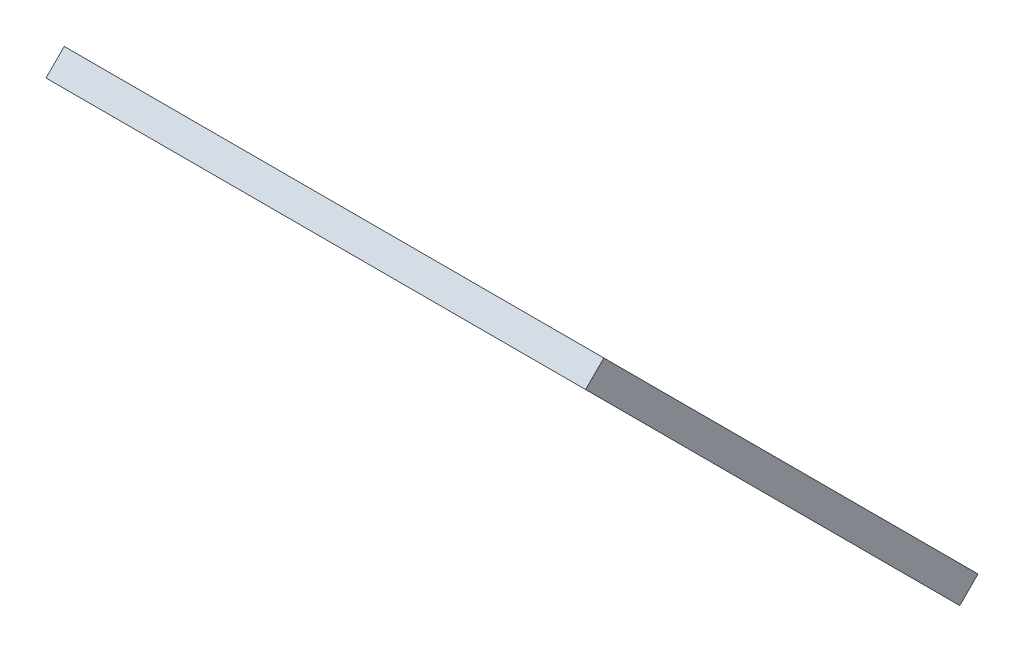
ISO-10303-21;
HEADER;
FILE_DESCRIPTION(('STEP AP214'),'2;1');
FILE_NAME('part.step','',(''),(''),'','','');
FILE_SCHEMA(('AUTOMOTIVE_DESIGN { 1 0 10303 214 1 1 1 1 }'));
ENDSEC;
DATA;
#1=APPLICATION_CONTEXT('core data for automotive mechanical design processes');
#2=APPLICATION_PROTOCOL_DEFINITION('international standard','automotive_design',2000,#1);
#3=PRODUCT_CONTEXT('',#1,'mechanical');
#4=PRODUCT('Part','Part','',(#3));
#5=PRODUCT_RELATED_PRODUCT_CATEGORY('part','',(#4));
#6=PRODUCT_DEFINITION_FORMATION('','',#4);
#7=PRODUCT_DEFINITION_CONTEXT('part definition',#1,'design');
#8=PRODUCT_DEFINITION('design','',#6,#7);
#9=PRODUCT_DEFINITION_SHAPE('','',#8);
#10=(LENGTH_UNIT() NAMED_UNIT(*) SI_UNIT(.MILLI.,.METRE.));
#11=(NAMED_UNIT(*) PLANE_ANGLE_UNIT() SI_UNIT($,.RADIAN.));
#12=(NAMED_UNIT(*) SI_UNIT($,.STERADIAN.) SOLID_ANGLE_UNIT());
#13=UNCERTAINTY_MEASURE_WITH_UNIT(LENGTH_MEASURE(1.E-05),#10,'distance_accuracy_value','');
#14=(GEOMETRIC_REPRESENTATION_CONTEXT(3) GLOBAL_UNCERTAINTY_ASSIGNED_CONTEXT((#13)) GLOBAL_UNIT_ASSIGNED_CONTEXT((#10,
#11,#12)) REPRESENTATION_CONTEXT('',''));
#15=CARTESIAN_POINT('',(0.,0.,0.));
#16=DIRECTION('',(0.,0.,1.));
#17=DIRECTION('',(1.,0.,0.));
#18=AXIS2_PLACEMENT_3D('',#15,#16,#17);
#19=CARTESIAN_POINT('',(4.90690319754844,-160.067589523144,2.85671139599364));
#20=DIRECTION('',(0.,0.707106781186547,0.707106781186548));
#21=DIRECTION('',(0.,-0.707106781186548,0.707106781186547));
#22=AXIS2_PLACEMENT_3D('',#19,#20,#21);
#23=PLANE('',#22);
#24=DIRECTION('',(1.,0.,0.));
#25=VECTOR('',#24,1.);
#26=CARTESIAN_POINT('',(4.90690319754844,-157.946269179585,0.735391052434));
#27=LINE('',#26,#25);
#28=CARTESIAN_POINT('',(4.90690319754844,-157.946269179585,0.735391052434));
#29=VERTEX_POINT('',#28);
#30=CARTESIAN_POINT('',(111.164878,-157.946269179585,0.735391052434));
#31=VERTEX_POINT('',#30);
#32=EDGE_CURVE('E96',#29,#31,#27,.T.);
#33=ORIENTED_EDGE('',*,*,#32,.T.);
#34=DIRECTION('',(0.,0.707106781186548,-0.707106781186547));
#35=VECTOR('',#34,1.);
#36=CARTESIAN_POINT('',(111.164878,-160.067589523144,2.85671139599364));
#37=LINE('',#36,#35);
#38=CARTESIAN_POINT('',(111.164878,-160.067589523144,2.85671139599364));
#39=VERTEX_POINT('',#38);
#40=EDGE_CURVE('E11',#39,#31,#37,.T.);
#41=ORIENTED_EDGE('',*,*,#40,.F.);
#42=DIRECTION('',(1.,0.,0.));
#43=VECTOR('',#42,1.);
#44=CARTESIAN_POINT('',(4.90690319754844,-160.067589523144,2.85671139599364));
#45=LINE('',#44,#43);
#46=CARTESIAN_POINT('',(4.90690319754844,-160.067589523144,2.85671139599364));
#47=VERTEX_POINT('',#46);
#48=EDGE_CURVE('E84',#47,#39,#45,.T.);
#49=ORIENTED_EDGE('',*,*,#48,.F.);
#50=DIRECTION('',(0.,0.707106781186548,-0.707106781186547));
#51=VECTOR('',#50,1.);
#52=CARTESIAN_POINT('',(4.90690319754844,-160.067589523144,2.85671139599364));
#53=LINE('',#52,#51);
#54=EDGE_CURVE('E92',#47,#29,#53,.T.);
#55=ORIENTED_EDGE('',*,*,#54,.T.);
#56=EDGE_LOOP('',(#33,#41,#49,#55));
#57=FACE_BOUND('',#56,.T.);
#58=ADVANCED_FACE('F33',(#57),#23,.F.);
#59=CARTESIAN_POINT('',(111.164878,-160.067589523144,2.85671139599364));
#60=DIRECTION('',(-1.,0.,0.));
#61=DIRECTION('',(0.,0.,1.));
#62=AXIS2_PLACEMENT_3D('',#59,#60,#61);
#63=PLANE('',#62);
#64=DIRECTION('',(0.,0.707106781186547,0.707106781186548));
#65=VECTOR('',#64,1.);
#66=CARTESIAN_POINT('',(111.164878,-157.946269179585,0.735391052434));
#67=LINE('',#66,#65);
#68=CARTESIAN_POINT('',(111.164878,-114.440269052434,44.2413911795845));
#69=VERTEX_POINT('',#68);
#70=EDGE_CURVE('E88',#31,#69,#67,.T.);
#71=ORIENTED_EDGE('',*,*,#70,.T.);
#72=DIRECTION('',(0.,0.707106781186548,-0.707106781186547));
#73=VECTOR('',#72,1.);
#74=CARTESIAN_POINT('',(111.164878,-116.561589395994,46.3627115231441));
#75=LINE('',#74,#73);
#76=CARTESIAN_POINT('',(111.164878,-116.561589395994,46.3627115231441));
#77=VERTEX_POINT('',#76);
#78=EDGE_CURVE('E41',#77,#69,#75,.T.);
#79=ORIENTED_EDGE('',*,*,#78,.F.);
#80=DIRECTION('',(0.,0.707106781186547,0.707106781186548));
#81=VECTOR('',#80,1.);
#82=CARTESIAN_POINT('',(111.164878,-160.067589523144,2.85671139599364));
#83=LINE('',#82,#81);
#84=EDGE_CURVE('E79',#39,#77,#83,.T.);
#85=ORIENTED_EDGE('',*,*,#84,.F.);
#86=ORIENTED_EDGE('',*,*,#40,.T.);
#87=EDGE_LOOP('',(#71,#79,#85,#86));
#88=FACE_BOUND('',#87,.T.);
#89=ADVANCED_FACE('F87',(#88),#63,.F.);
#90=CARTESIAN_POINT('',(111.164878,-116.561589395994,46.3627115231441));
#91=DIRECTION('',(0.,-0.707106781186547,-0.707106781186548));
#92=DIRECTION('',(0.,0.707106781186548,-0.707106781186547));
#93=AXIS2_PLACEMENT_3D('',#90,#91,#92);
#94=PLANE('',#93);
#95=DIRECTION('',(-1.,0.,0.));
#96=VECTOR('',#95,1.);
#97=CARTESIAN_POINT('',(111.164878,-114.440269052434,44.2413911795845));
#98=LINE('',#97,#96);
#99=CARTESIAN_POINT('',(48.4129033246988,-114.440269052434,44.2413911795845));
#100=VERTEX_POINT('',#99);
#101=EDGE_CURVE('E66',#69,#100,#98,.T.);
#102=ORIENTED_EDGE('',*,*,#101,.T.);
#103=DIRECTION('',(0.,0.707106781186548,-0.707106781186547));
#104=VECTOR('',#103,1.);
#105=CARTESIAN_POINT('',(48.4129033246988,-116.561589395994,46.3627115231441));
#106=LINE('',#105,#104);
#107=CARTESIAN_POINT('',(48.4129033246988,-116.561589395994,46.3627115231441));
#108=VERTEX_POINT('',#107);
#109=EDGE_CURVE('E89',#108,#100,#106,.T.);
#110=ORIENTED_EDGE('',*,*,#109,.F.);
#111=DIRECTION('',(-1.,0.,0.));
#112=VECTOR('',#111,1.);
#113=CARTESIAN_POINT('',(111.164878,-116.561589395994,46.3627115231441));
#114=LINE('',#113,#112);
#115=EDGE_CURVE('E82',#77,#108,#114,.T.);
#116=ORIENTED_EDGE('',*,*,#115,.F.);
#117=ORIENTED_EDGE('',*,*,#78,.T.);
#118=EDGE_LOOP('',(#102,#110,#116,#117));
#119=FACE_BOUND('',#118,.T.);
#120=ADVANCED_FACE('F90',(#119),#94,.F.);
#121=CARTESIAN_POINT('',(48.4129033246988,-116.561589395994,46.3627115231441));
#122=DIRECTION('',(0.816496580927726,-0.408248290463862,-0.408248290463863));
#123=DIRECTION('',(-0.447213595499957,0.,-0.894427190999916));
#124=AXIS2_PLACEMENT_3D('',#121,#122,#123);
#125=PLANE('',#124);
#126=DIRECTION('',(-0.577350269189625,-0.577350269189626,-0.577350269189626));
#127=VECTOR('',#126,1.);
#128=CARTESIAN_POINT('',(48.4129033246988,-114.440269052434,44.2413911795845));
#129=LINE('',#128,#127);
#130=EDGE_CURVE('E72',#100,#29,#129,.T.);
#131=ORIENTED_EDGE('',*,*,#130,.T.);
#132=ORIENTED_EDGE('',*,*,#54,.F.);
#133=DIRECTION('',(-0.577350269189625,-0.577350269189626,-0.577350269189626));
#134=VECTOR('',#133,1.);
#135=CARTESIAN_POINT('',(48.4129033246988,-116.561589395994,46.3627115231441));
#136=LINE('',#135,#134);
#137=EDGE_CURVE('E49',#108,#47,#136,.T.);
#138=ORIENTED_EDGE('',*,*,#137,.F.);
#139=ORIENTED_EDGE('',*,*,#109,.T.);
#140=EDGE_LOOP('',(#131,#132,#138,#139));
#141=FACE_BOUND('',#140,.T.);
#142=ADVANCED_FACE('F103',(#141),#125,.F.);
#143=CARTESIAN_POINT('',(0.,-81.462150459569,81.4621504595689));
#144=DIRECTION('',(0.,-0.707106781186548,0.707106781186547));
#145=DIRECTION('',(0.,-0.707106781186547,-0.707106781186548));
#146=AXIS2_PLACEMENT_3D('',#143,#144,#145);
#147=PLANE('',#146);
#148=ORIENTED_EDGE('',*,*,#48,.T.);
#149=ORIENTED_EDGE('',*,*,#84,.T.);
#150=ORIENTED_EDGE('',*,*,#115,.T.);
#151=ORIENTED_EDGE('',*,*,#137,.T.);
#152=EDGE_LOOP('',(#148,#149,#150,#151));
#153=FACE_BOUND('',#152,.T.);
#154=ADVANCED_FACE('F80',(#153),#147,.T.);
#155=CARTESIAN_POINT('',(0.,-79.3408301160093,79.3408301160093));
#156=DIRECTION('',(0.,-0.707106781186548,0.707106781186547));
#157=DIRECTION('',(0.,-0.707106781186547,-0.707106781186548));
#158=AXIS2_PLACEMENT_3D('',#155,#156,#157);
#159=PLANE('',#158);
#160=ORIENTED_EDGE('',*,*,#32,.F.);
#161=ORIENTED_EDGE('',*,*,#130,.F.);
#162=ORIENTED_EDGE('',*,*,#101,.F.);
#163=ORIENTED_EDGE('',*,*,#70,.F.);
#164=EDGE_LOOP('',(#160,#161,#162,#163));
#165=FACE_BOUND('',#164,.T.);
#166=ADVANCED_FACE('F106',(#165),#159,.F.);
#167=CLOSED_SHELL('',(#58,#89,#120,#142,#154,#166));
#168=MANIFOLD_SOLID_BREP('B2',#167);
#169=ADVANCED_BREP_SHAPE_REPRESENTATION('',(#18,#168),#14);
#170=SHAPE_DEFINITION_REPRESENTATION(#9,#169);
ENDSEC;
END-ISO-10303-21;
